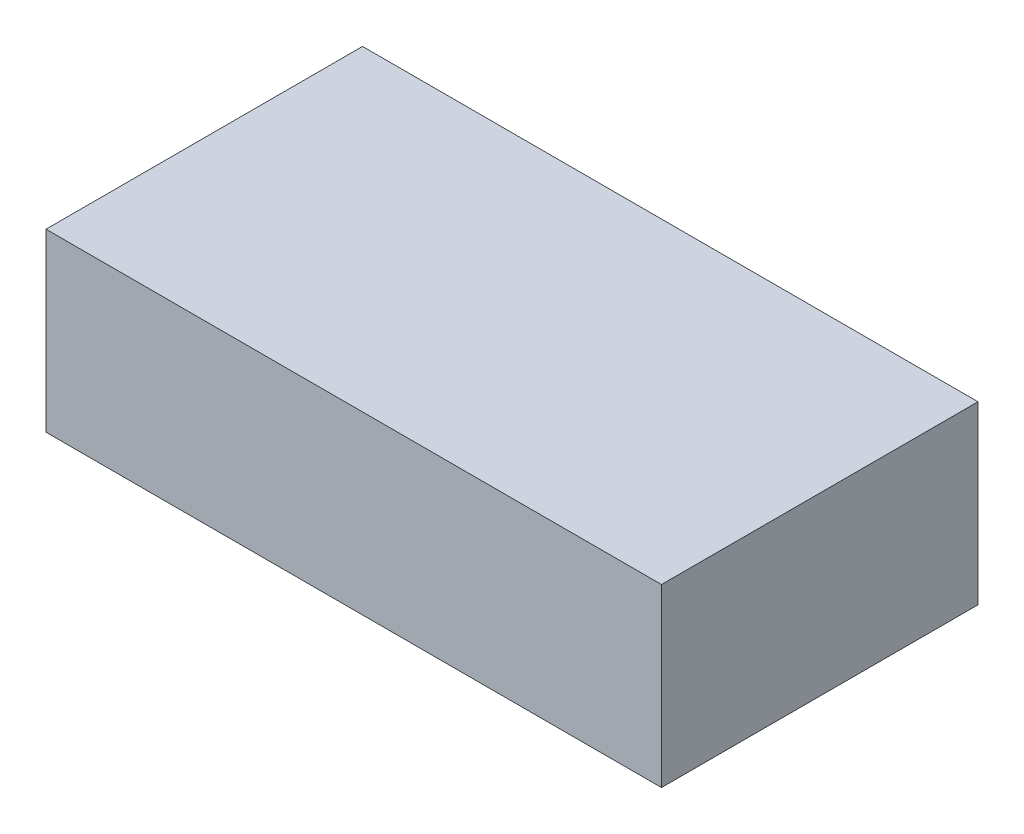
ISO-10303-21;
HEADER;
FILE_DESCRIPTION(('STEP AP214'),'2;1');
FILE_NAME('part.step','',(''),(''),'','','');
FILE_SCHEMA(('AUTOMOTIVE_DESIGN { 1 0 10303 214 1 1 1 1 }'));
ENDSEC;
DATA;
#1=APPLICATION_CONTEXT('core data for automotive mechanical design processes');
#2=APPLICATION_PROTOCOL_DEFINITION('international standard','automotive_design',2000,#1);
#3=PRODUCT_CONTEXT('',#1,'mechanical');
#4=PRODUCT('Part','Part','',(#3));
#5=PRODUCT_RELATED_PRODUCT_CATEGORY('part','',(#4));
#6=PRODUCT_DEFINITION_FORMATION('','',#4);
#7=PRODUCT_DEFINITION_CONTEXT('part definition',#1,'design');
#8=PRODUCT_DEFINITION('design','',#6,#7);
#9=PRODUCT_DEFINITION_SHAPE('','',#8);
#10=(LENGTH_UNIT() NAMED_UNIT(*) SI_UNIT(.MILLI.,.METRE.));
#11=(NAMED_UNIT(*) PLANE_ANGLE_UNIT() SI_UNIT($,.RADIAN.));
#12=(NAMED_UNIT(*) SI_UNIT($,.STERADIAN.) SOLID_ANGLE_UNIT());
#13=UNCERTAINTY_MEASURE_WITH_UNIT(LENGTH_MEASURE(1.E-05),#10,'distance_accuracy_value','');
#14=(GEOMETRIC_REPRESENTATION_CONTEXT(3) GLOBAL_UNCERTAINTY_ASSIGNED_CONTEXT((#13)) GLOBAL_UNIT_ASSIGNED_CONTEXT((#10,
#11,#12)) REPRESENTATION_CONTEXT('',''));
#15=CARTESIAN_POINT('',(0.,0.,0.));
#16=DIRECTION('',(0.,0.,1.));
#17=DIRECTION('',(1.,0.,0.));
#18=AXIS2_PLACEMENT_3D('',#15,#16,#17);
#19=CARTESIAN_POINT('',(17.4999999999947,10.,-9.0000000000009));
#20=DIRECTION('',(-1.,0.,0.));
#21=DIRECTION('',(0.,0.,1.));
#22=AXIS2_PLACEMENT_3D('',#19,#20,#21);
#23=PLANE('',#22);
#24=DIRECTION('',(0.,0.,-1.));
#25=VECTOR('',#24,1.);
#26=CARTESIAN_POINT('',(17.4999999999947,0.,-9.0000000000009));
#27=LINE('',#26,#25);
#28=CARTESIAN_POINT('',(17.4999999999947,0.,8.9999999999991));
#29=VERTEX_POINT('',#28);
#30=CARTESIAN_POINT('',(17.4999999999947,0.,-9.0000000000009));
#31=VERTEX_POINT('',#30);
#32=EDGE_CURVE('E97',#29,#31,#27,.T.);
#33=ORIENTED_EDGE('',*,*,#32,.T.);
#34=DIRECTION('',(0.,-1.,0.));
#35=VECTOR('',#34,1.);
#36=CARTESIAN_POINT('',(17.4999999999947,10.,-9.0000000000009));
#37=LINE('',#36,#35);
#38=CARTESIAN_POINT('',(17.4999999999947,10.,-9.0000000000009));
#39=VERTEX_POINT('',#38);
#40=EDGE_CURVE('E11',#39,#31,#37,.T.);
#41=ORIENTED_EDGE('',*,*,#40,.F.);
#42=DIRECTION('',(0.,0.,-1.));
#43=VECTOR('',#42,1.);
#44=CARTESIAN_POINT('',(17.4999999999947,10.,-9.0000000000009));
#45=LINE('',#44,#43);
#46=CARTESIAN_POINT('',(17.4999999999947,10.,8.9999999999991));
#47=VERTEX_POINT('',#46);
#48=EDGE_CURVE('E85',#47,#39,#45,.T.);
#49=ORIENTED_EDGE('',*,*,#48,.F.);
#50=DIRECTION('',(0.,-1.,0.));
#51=VECTOR('',#50,1.);
#52=CARTESIAN_POINT('',(17.4999999999947,10.,8.9999999999991));
#53=LINE('',#52,#51);
#54=EDGE_CURVE('E93',#47,#29,#53,.T.);
#55=ORIENTED_EDGE('',*,*,#54,.T.);
#56=EDGE_LOOP('',(#33,#41,#49,#55));
#57=FACE_BOUND('',#56,.T.);
#58=ADVANCED_FACE('F34',(#57),#23,.F.);
#59=CARTESIAN_POINT('',(-17.500000000009,10.,-9.0000000000009));
#60=DIRECTION('',(0.,0.,1.));
#61=DIRECTION('',(1.,0.,0.));
#62=AXIS2_PLACEMENT_3D('',#59,#60,#61);
#63=PLANE('',#62);
#64=DIRECTION('',(-1.,0.,0.));
#65=VECTOR('',#64,1.);
#66=CARTESIAN_POINT('',(-17.500000000009,0.,-9.0000000000009));
#67=LINE('',#66,#65);
#68=CARTESIAN_POINT('',(-17.500000000009,0.,-9.0000000000009));
#69=VERTEX_POINT('',#68);
#70=EDGE_CURVE('E89',#31,#69,#67,.T.);
#71=ORIENTED_EDGE('',*,*,#70,.T.);
#72=DIRECTION('',(0.,-1.,0.));
#73=VECTOR('',#72,1.);
#74=CARTESIAN_POINT('',(-17.500000000009,10.,-9.0000000000009));
#75=LINE('',#74,#73);
#76=CARTESIAN_POINT('',(-17.500000000009,10.,-9.0000000000009));
#77=VERTEX_POINT('',#76);
#78=EDGE_CURVE('E42',#77,#69,#75,.T.);
#79=ORIENTED_EDGE('',*,*,#78,.F.);
#80=DIRECTION('',(-1.,0.,0.));
#81=VECTOR('',#80,1.);
#82=CARTESIAN_POINT('',(-17.500000000009,10.,-9.0000000000009));
#83=LINE('',#82,#81);
#84=EDGE_CURVE('E80',#39,#77,#83,.T.);
#85=ORIENTED_EDGE('',*,*,#84,.F.);
#86=ORIENTED_EDGE('',*,*,#40,.T.);
#87=EDGE_LOOP('',(#71,#79,#85,#86));
#88=FACE_BOUND('',#87,.T.);
#89=ADVANCED_FACE('F88',(#88),#63,.F.);
#90=CARTESIAN_POINT('',(-17.500000000009,10.,-9.0000000000009));
#91=DIRECTION('',(1.,0.,0.));
#92=DIRECTION('',(0.,0.,-1.));
#93=AXIS2_PLACEMENT_3D('',#90,#91,#92);
#94=PLANE('',#93);
#95=DIRECTION('',(0.,0.,1.));
#96=VECTOR('',#95,1.);
#97=CARTESIAN_POINT('',(-17.500000000009,0.,-9.0000000000009));
#98=LINE('',#97,#96);
#99=CARTESIAN_POINT('',(-17.500000000009,0.,8.9999999999991));
#100=VERTEX_POINT('',#99);
#101=EDGE_CURVE('E67',#69,#100,#98,.T.);
#102=ORIENTED_EDGE('',*,*,#101,.T.);
#103=DIRECTION('',(0.,-1.,0.));
#104=VECTOR('',#103,1.);
#105=CARTESIAN_POINT('',(-17.500000000009,10.,8.9999999999991));
#106=LINE('',#105,#104);
#107=CARTESIAN_POINT('',(-17.500000000009,10.,8.9999999999991));
#108=VERTEX_POINT('',#107);
#109=EDGE_CURVE('E90',#108,#100,#106,.T.);
#110=ORIENTED_EDGE('',*,*,#109,.F.);
#111=DIRECTION('',(0.,0.,1.));
#112=VECTOR('',#111,1.);
#113=CARTESIAN_POINT('',(-17.500000000009,10.,-9.0000000000009));
#114=LINE('',#113,#112);
#115=EDGE_CURVE('E83',#77,#108,#114,.T.);
#116=ORIENTED_EDGE('',*,*,#115,.F.);
#117=ORIENTED_EDGE('',*,*,#78,.T.);
#118=EDGE_LOOP('',(#102,#110,#116,#117));
#119=FACE_BOUND('',#118,.T.);
#120=ADVANCED_FACE('F91',(#119),#94,.F.);
#121=CARTESIAN_POINT('',(-17.500000000009,10.,8.9999999999991));
#122=DIRECTION('',(0.,0.,-1.));
#123=DIRECTION('',(-1.,0.,0.));
#124=AXIS2_PLACEMENT_3D('',#121,#122,#123);
#125=PLANE('',#124);
#126=DIRECTION('',(1.,0.,0.));
#127=VECTOR('',#126,1.);
#128=CARTESIAN_POINT('',(-17.500000000009,0.,8.9999999999991));
#129=LINE('',#128,#127);
#130=EDGE_CURVE('E73',#100,#29,#129,.T.);
#131=ORIENTED_EDGE('',*,*,#130,.T.);
#132=ORIENTED_EDGE('',*,*,#54,.F.);
#133=DIRECTION('',(1.,0.,0.));
#134=VECTOR('',#133,1.);
#135=CARTESIAN_POINT('',(-17.500000000009,10.,8.9999999999991));
#136=LINE('',#135,#134);
#137=EDGE_CURVE('E50',#108,#47,#136,.T.);
#138=ORIENTED_EDGE('',*,*,#137,.F.);
#139=ORIENTED_EDGE('',*,*,#109,.T.);
#140=EDGE_LOOP('',(#131,#132,#138,#139));
#141=FACE_BOUND('',#140,.T.);
#142=ADVANCED_FACE('F104',(#141),#125,.F.);
#143=CARTESIAN_POINT('',(0.,10.,0.));
#144=DIRECTION('',(0.,1.,0.));
#145=DIRECTION('',(0.,0.,1.));
#146=AXIS2_PLACEMENT_3D('',#143,#144,#145);
#147=PLANE('',#146);
#148=ORIENTED_EDGE('',*,*,#48,.T.);
#149=ORIENTED_EDGE('',*,*,#84,.T.);
#150=ORIENTED_EDGE('',*,*,#115,.T.);
#151=ORIENTED_EDGE('',*,*,#137,.T.);
#152=EDGE_LOOP('',(#148,#149,#150,#151));
#153=FACE_BOUND('',#152,.T.);
#154=ADVANCED_FACE('F81',(#153),#147,.T.);
#155=CARTESIAN_POINT('',(0.,0.,0.));
#156=DIRECTION('',(0.,1.,0.));
#157=DIRECTION('',(0.,0.,1.));
#158=AXIS2_PLACEMENT_3D('',#155,#156,#157);
#159=PLANE('',#158);
#160=ORIENTED_EDGE('',*,*,#32,.F.);
#161=ORIENTED_EDGE('',*,*,#130,.F.);
#162=ORIENTED_EDGE('',*,*,#101,.F.);
#163=ORIENTED_EDGE('',*,*,#70,.F.);
#164=EDGE_LOOP('',(#160,#161,#162,#163));
#165=FACE_BOUND('',#164,.T.);
#166=ADVANCED_FACE('F107',(#165),#159,.F.);
#167=CLOSED_SHELL('',(#58,#89,#120,#142,#154,#166));
#168=MANIFOLD_SOLID_BREP('B2',#167);
#169=ADVANCED_BREP_SHAPE_REPRESENTATION('',(#18,#168),#14);
#170=SHAPE_DEFINITION_REPRESENTATION(#9,#169);
ENDSEC;
END-ISO-10303-21;
